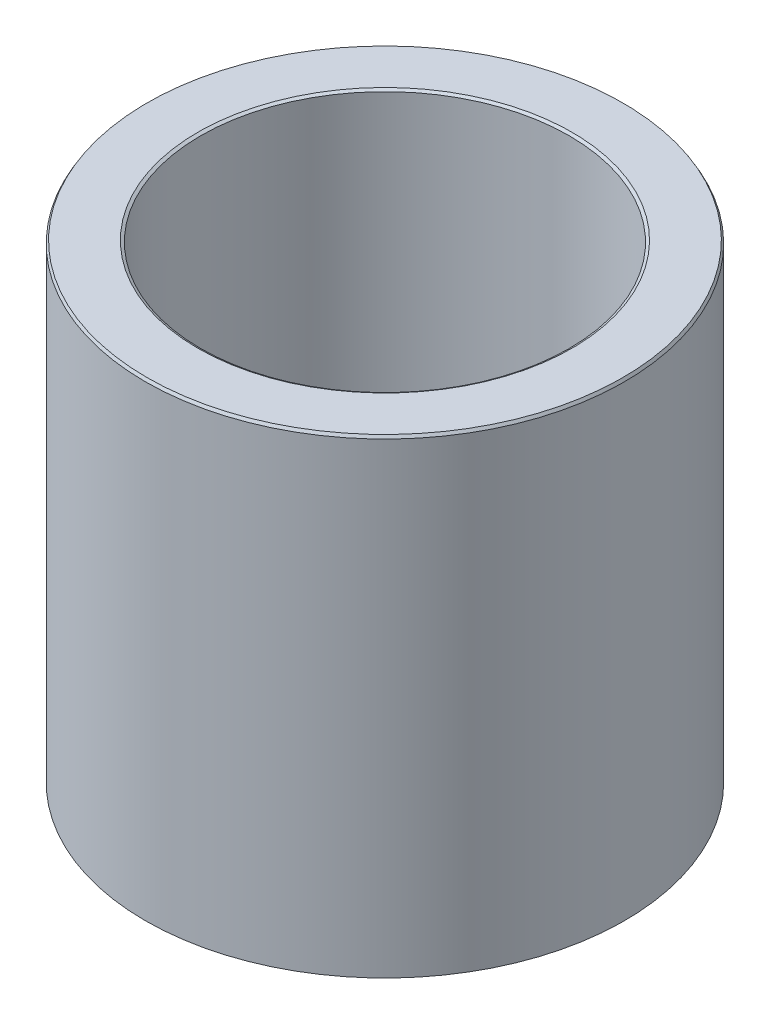
ISO-10303-21;
HEADER;
FILE_DESCRIPTION(('STEP AP214'),'2;1');
FILE_NAME('part.step','',(''),(''),'','','');
FILE_SCHEMA(('AUTOMOTIVE_DESIGN { 1 0 10303 214 1 1 1 1 }'));
ENDSEC;
DATA;
#1=APPLICATION_CONTEXT('core data for automotive mechanical design processes');
#2=APPLICATION_PROTOCOL_DEFINITION('international standard','automotive_design',2000,#1);
#3=PRODUCT_CONTEXT('',#1,'mechanical');
#4=PRODUCT('Part','Part','',(#3));
#5=PRODUCT_RELATED_PRODUCT_CATEGORY('part','',(#4));
#6=PRODUCT_DEFINITION_FORMATION('','',#4);
#7=PRODUCT_DEFINITION_CONTEXT('part definition',#1,'design');
#8=PRODUCT_DEFINITION('design','',#6,#7);
#9=PRODUCT_DEFINITION_SHAPE('','',#8);
#10=(LENGTH_UNIT() NAMED_UNIT(*) SI_UNIT(.MILLI.,.METRE.));
#11=(NAMED_UNIT(*) PLANE_ANGLE_UNIT() SI_UNIT($,.RADIAN.));
#12=(NAMED_UNIT(*) SI_UNIT($,.STERADIAN.) SOLID_ANGLE_UNIT());
#13=UNCERTAINTY_MEASURE_WITH_UNIT(LENGTH_MEASURE(1.E-05),#10,'distance_accuracy_value','');
#14=(GEOMETRIC_REPRESENTATION_CONTEXT(3) GLOBAL_UNCERTAINTY_ASSIGNED_CONTEXT((#13)) GLOBAL_UNIT_ASSIGNED_CONTEXT((#10,
#11,#12)) REPRESENTATION_CONTEXT('',''));
#15=CARTESIAN_POINT('',(0.,0.,0.));
#16=DIRECTION('',(0.,0.,1.));
#17=DIRECTION('',(1.,0.,0.));
#18=AXIS2_PLACEMENT_3D('',#15,#16,#17);
#19=CARTESIAN_POINT('',(0.,108.201678692857,0.));
#20=DIRECTION('',(0.,-1.,0.));
#21=DIRECTION('',(0.,0.,-1.));
#22=AXIS2_PLACEMENT_3D('',#19,#20,#21);
#23=CYLINDRICAL_SURFACE('',#22,55.);
#24=CARTESIAN_POINT('',(0.,0.373626773049751,0.));
#25=DIRECTION('',(0.,1.,0.));
#26=DIRECTION('',(0.,0.,1.));
#27=AXIS2_PLACEMENT_3D('',#24,#25,#26);
#28=CIRCLE('',#27,55.);
#29=CARTESIAN_POINT('',(0.,0.373626773049751,55.));
#30=VERTEX_POINT('',#29);
#31=EDGE_CURVE('E10',#30,#30,#28,.T.);
#32=ORIENTED_EDGE('',*,*,#31,.T.);
#33=EDGE_LOOP('',(#32));
#34=FACE_BOUND('',#33,.T.);
#35=CARTESIAN_POINT('',(0.,107.554538138867,0.));
#36=DIRECTION('',(0.,1.,0.));
#37=DIRECTION('',(0.,0.,1.));
#38=AXIS2_PLACEMENT_3D('',#35,#36,#37);
#39=CIRCLE('',#38,55.);
#40=CARTESIAN_POINT('',(0.,107.554538138867,55.));
#41=VERTEX_POINT('',#40);
#42=EDGE_CURVE('E50',#41,#41,#39,.F.);
#43=ORIENTED_EDGE('',*,*,#42,.T.);
#44=EDGE_LOOP('',(#43));
#45=FACE_BOUND('',#44,.T.);
#46=ADVANCED_FACE('F39',(#34,#45),#23,.T.);
#47=CARTESIAN_POINT('',(0.,108.201678692857,0.));
#48=DIRECTION('',(0.,1.,0.));
#49=DIRECTION('',(0.,0.,1.));
#50=AXIS2_PLACEMENT_3D('',#47,#48,#49);
#51=PLANE('',#50);
#52=CARTESIAN_POINT('',(0.,108.201678692857,0.));
#53=DIRECTION('',(0.,1.,0.));
#54=DIRECTION('',(0.,0.,1.));
#55=AXIS2_PLACEMENT_3D('',#52,#53,#54);
#56=CIRCLE('',#55,42.9613870123271);
#57=CARTESIAN_POINT('',(0.,108.201678692857,42.9613870123271));
#58=VERTEX_POINT('',#57);
#59=EDGE_CURVE('E58',#58,#58,#56,.F.);
#60=ORIENTED_EDGE('',*,*,#59,.T.);
#61=EDGE_LOOP('',(#60));
#62=FACE_BOUND('',#61,.T.);
#63=CARTESIAN_POINT('',(0.,108.201678692857,0.));
#64=DIRECTION('',(0.,1.,0.));
#65=DIRECTION('',(0.,0.,1.));
#66=AXIS2_PLACEMENT_3D('',#63,#64,#65);
#67=CIRCLE('',#66,54.6263732269502);
#68=CARTESIAN_POINT('',(0.,108.201678692857,54.6263732269502));
#69=VERTEX_POINT('',#68);
#70=EDGE_CURVE('E61',#69,#69,#67,.T.);
#71=ORIENTED_EDGE('',*,*,#70,.T.);
#72=EDGE_LOOP('',(#71));
#73=FACE_BOUND('',#72,.T.);
#74=ADVANCED_FACE('F88',(#62,#73),#51,.T.);
#75=CARTESIAN_POINT('',(0.,0.,0.));
#76=DIRECTION('',(0.,1.,0.));
#77=DIRECTION('',(0.,0.,1.));
#78=AXIS2_PLACEMENT_3D('',#75,#76,#77);
#79=PLANE('',#78);
#80=CARTESIAN_POINT('',(0.,0.,0.));
#81=DIRECTION('',(0.,1.,0.));
#82=DIRECTION('',(0.,0.,1.));
#83=AXIS2_PLACEMENT_3D('',#80,#81,#82);
#84=CIRCLE('',#83,42.6878732313868);
#85=CARTESIAN_POINT('',(0.,0.,-42.6878732313868));
#86=VERTEX_POINT('',#85);
#87=EDGE_CURVE('E51',#86,#86,#84,.T.);
#88=ORIENTED_EDGE('',*,*,#87,.T.);
#89=EDGE_LOOP('',(#88));
#90=FACE_BOUND('',#89,.T.);
#91=CARTESIAN_POINT('',(0.,0.,0.));
#92=DIRECTION('',(0.,1.,0.));
#93=DIRECTION('',(0.,0.,1.));
#94=AXIS2_PLACEMENT_3D('',#91,#92,#93);
#95=CIRCLE('',#94,54.3528594460098);
#96=CARTESIAN_POINT('',(0.,0.,54.3528594460098));
#97=VERTEX_POINT('',#96);
#98=EDGE_CURVE('E54',#97,#97,#95,.F.);
#99=ORIENTED_EDGE('',*,*,#98,.T.);
#100=EDGE_LOOP('',(#99));
#101=FACE_BOUND('',#100,.T.);
#102=ADVANCED_FACE('F83',(#90,#101),#79,.F.);
#103=CARTESIAN_POINT('',(0.,108.201678692857,0.));
#104=DIRECTION('',(0.,-1.,0.));
#105=DIRECTION('',(0.,0.,-1.));
#106=AXIS2_PLACEMENT_3D('',#103,#104,#105);
#107=CYLINDRICAL_SURFACE('',#106,42.314246458337);
#108=CARTESIAN_POINT('',(0.,107.828051919808,0.));
#109=DIRECTION('',(0.,1.,0.));
#110=DIRECTION('',(0.,0.,1.));
#111=AXIS2_PLACEMENT_3D('',#108,#109,#110);
#112=CIRCLE('',#111,42.314246458337);
#113=CARTESIAN_POINT('',(0.,107.828051919808,42.314246458337));
#114=VERTEX_POINT('',#113);
#115=EDGE_CURVE('E67',#114,#114,#112,.T.);
#116=ORIENTED_EDGE('',*,*,#115,.T.);
#117=EDGE_LOOP('',(#116));
#118=FACE_BOUND('',#117,.T.);
#119=CARTESIAN_POINT('',(0.,0.647140553990191,0.));
#120=DIRECTION('',(0.,1.,0.));
#121=DIRECTION('',(0.,0.,1.));
#122=AXIS2_PLACEMENT_3D('',#119,#120,#121);
#123=CIRCLE('',#122,42.314246458337);
#124=CARTESIAN_POINT('',(0.,0.647140553990191,-42.314246458337));
#125=VERTEX_POINT('',#124);
#126=EDGE_CURVE('E69',#125,#125,#123,.F.);
#127=ORIENTED_EDGE('',*,*,#126,.T.);
#128=EDGE_LOOP('',(#127));
#129=FACE_BOUND('',#128,.T.);
#130=ADVANCED_FACE('F71',(#118,#129),#107,.F.);
#131=CARTESIAN_POINT('',(0.,107.828051919808,0.));
#132=DIRECTION('',(0.,1.,0.));
#133=DIRECTION('',(0.,0.,1.));
#134=AXIS2_PLACEMENT_3D('',#131,#132,#133);
#135=CONICAL_SURFACE('',#134,42.314246458337,1.04719755119659);
#136=ORIENTED_EDGE('',*,*,#59,.F.);
#137=EDGE_LOOP('',(#136));
#138=FACE_BOUND('',#137,.T.);
#139=ORIENTED_EDGE('',*,*,#115,.F.);
#140=EDGE_LOOP('',(#139));
#141=FACE_BOUND('',#140,.T.);
#142=ADVANCED_FACE('F77',(#138,#141),#135,.F.);
#143=CARTESIAN_POINT('',(0.,0.,0.));
#144=DIRECTION('',(0.,-1.,0.));
#145=DIRECTION('',(0.,0.,-1.));
#146=AXIS2_PLACEMENT_3D('',#143,#144,#145);
#147=CONICAL_SURFACE('',#146,42.6878732313868,0.523598775598296);
#148=CARTESIAN_POINT('',(0.,0.647140553990191,-42.314246458337));
#149=CARTESIAN_POINT('',(0.,0.640399506552795,-42.3181384038896));
#150=CARTESIAN_POINT('',(0.,0.633658459115397,-42.3220303494422));
#151=CARTESIAN_POINT('',(0.,0.6201763642406,-42.3298142405474));
#152=CARTESIAN_POINT('',(0.,0.613435316803202,-42.3337061861));
#153=CARTESIAN_POINT('',(0.,0.599953221928406,-42.3414900772052));
#154=CARTESIAN_POINT('',(0.,0.593212174491009,-42.3453820227578));
#155=CARTESIAN_POINT('',(0.,0.579730079616214,-42.353165913863));
#156=CARTESIAN_POINT('',(0.,0.572989032178815,-42.3570578594156));
#157=CARTESIAN_POINT('',(0.,0.559506937304019,-42.3648417505208));
#158=CARTESIAN_POINT('',(0.,0.552765889866622,-42.3687336960734));
#159=CARTESIAN_POINT('',(0.,0.539283794991827,-42.3765175871786));
#160=CARTESIAN_POINT('',(0.,0.532542747554428,-42.3804095327312));
#161=CARTESIAN_POINT('',(0.,0.519060652679632,-42.3881934238364));
#162=CARTESIAN_POINT('',(0.,0.512319605242235,-42.392085369389));
#163=CARTESIAN_POINT('',(0.,0.49883751036744,-42.3998692604942));
#164=CARTESIAN_POINT('',(0.,0.492096462930041,-42.4037612060468));
#165=CARTESIAN_POINT('',(0.,0.478614368055245,-42.411545097152));
#166=CARTESIAN_POINT('',(0.,0.471873320617848,-42.4154370427046));
#167=CARTESIAN_POINT('',(0.,0.458391225743053,-42.4232209338098));
#168=CARTESIAN_POINT('',(0.,0.451650178305654,-42.4271128793624));
#169=CARTESIAN_POINT('',(0.,0.438168083430858,-42.4348967704676));
#170=CARTESIAN_POINT('',(0.,0.431427035993461,-42.4387887160202));
#171=CARTESIAN_POINT('',(0.,0.417944941118666,-42.4465726071254));
#172=CARTESIAN_POINT('',(0.,0.411203893681267,-42.450464552678));
#173=CARTESIAN_POINT('',(0.,0.397721798806471,-42.4582484437832));
#174=CARTESIAN_POINT('',(0.,0.390980751369074,-42.4621403893359));
#175=CARTESIAN_POINT('',(0.,0.377498656494279,-42.4699242804411));
#176=CARTESIAN_POINT('',(0.,0.37075760905688,-42.4738162259937));
#177=CARTESIAN_POINT('',(0.,0.357275514182084,-42.4816001170989));
#178=CARTESIAN_POINT('',(0.,0.350534466744687,-42.4854920626515));
#179=CARTESIAN_POINT('',(0.,0.337052371869892,-42.4932759537567));
#180=CARTESIAN_POINT('',(0.,0.330311324432493,-42.4971678993093));
#181=CARTESIAN_POINT('',(0.,0.316829229557697,-42.5049517904145));
#182=CARTESIAN_POINT('',(0.,0.3100881821203,-42.5088437359671));
#183=CARTESIAN_POINT('',(0.,0.296606087245505,-42.5166276270723));
#184=CARTESIAN_POINT('',(0.,0.289865039808107,-42.5205195726249));
#185=CARTESIAN_POINT('',(0.,0.276382944933311,-42.5283034637301));
#186=CARTESIAN_POINT('',(0.,0.269641897495912,-42.5321954092827));
#187=CARTESIAN_POINT('',(0.,0.256159802621117,-42.5399793003879));
#188=CARTESIAN_POINT('',(0.,0.24941875518372,-42.5438712459405));
#189=CARTESIAN_POINT('',(0.,0.235936660308924,-42.5516551370457));
#190=CARTESIAN_POINT('',(0.,0.229195612871526,-42.5555470825983));
#191=CARTESIAN_POINT('',(0.,0.21571351799673,-42.5633309737035));
#192=CARTESIAN_POINT('',(0.,0.208972470559333,-42.5672229192561));
#193=CARTESIAN_POINT('',(0.,0.195490375684537,-42.5750068103613));
#194=CARTESIAN_POINT('',(0.,0.188749328247139,-42.5788987559139));
#195=CARTESIAN_POINT('',(0.,0.175267233372343,-42.5866826470191));
#196=CARTESIAN_POINT('',(0.,0.168526185934946,-42.5905745925717));
#197=CARTESIAN_POINT('',(0.,0.155044091060151,-42.5983584836769));
#198=CARTESIAN_POINT('',(0.,0.148303043622752,-42.6022504292295));
#199=CARTESIAN_POINT('',(0.,0.134820948747956,-42.6100343203347));
#200=CARTESIAN_POINT('',(0.,0.128079901310559,-42.6139262658873));
#201=CARTESIAN_POINT('',(0.,0.114597806435764,-42.6217101569925));
#202=CARTESIAN_POINT('',(0.,0.107856758998365,-42.6256021025451));
#203=CARTESIAN_POINT('',(0.,0.0943746641235691,-42.6333859936503));
#204=CARTESIAN_POINT('',(0.,0.0876336166861722,-42.6372779392029));
#205=CARTESIAN_POINT('',(0.,0.0741515218113766,-42.6450618303081));
#206=CARTESIAN_POINT('',(0.,0.0674104743739778,-42.6489537758607));
#207=CARTESIAN_POINT('',(0.,0.0539283794991821,-42.6567376669659));
#208=CARTESIAN_POINT('',(0.,0.0471873320617851,-42.6606296125185));
#209=CARTESIAN_POINT('',(0.,0.0337052371869898,-42.6684135036237));
#210=CARTESIAN_POINT('',(0.,0.0269641897495914,-42.6723054491763));
#211=CARTESIAN_POINT('',(0.,0.0134820948747946,-42.6800893402815));
#212=CARTESIAN_POINT('',(0.,0.00674104743739618,-42.6839812858341));
#213=CARTESIAN_POINT('',(0.,0.,-42.6878732313868));
#214=B_SPLINE_CURVE_WITH_KNOTS('',3,(#148,#149,#150,#151,#152,#153,#154,#155,#156,#157,#158,
#159,#160,#161,#162,#163,#164,#165,#166,#167,#168,#169,#170,#171,#172,#173,#174,#175,#176,#177,
#178,#179,#180,#181,#182,#183,#184,#185,#186,#187,#188,#189,#190,#191,#192,#193,#194,#195,#196,
#197,#198,#199,#200,#201,#202,#203,#204,#205,#206,#207,#208,#209,#210,#211,#212,#213),
.UNSPECIFIED.,.F.,.F.,(4,2,2,2,2,2,2,2,2,2,2,2,2,2,2,2,2,2,2,2,2,2,2,2,2,2,2,2,2,2,2,2,4),(0.,
0.0233516733156116,0.0467033466312198,0.0700550199468314,0.0934066932624396,0.116758366578051,
0.140110039893659,0.163461713209271,0.186813386524879,0.210165059840491,0.233516733156099,
0.25686840647171,0.280220079787319,0.30357175310293,0.326923426418538,0.35027509973415,
0.373626773049758,0.39697844636537,0.420330119680981,0.443681792996589,0.467033466312201,
0.490385139627809,0.513736812943421,0.537088486259029,0.560440159574641,0.583791832890249,
0.60714350620586,0.630495179521469,0.65384685283708,0.677198526152688,0.7005501994683,
0.723901872783908,0.74725354609952),.UNSPECIFIED.);
#215=EDGE_CURVE('BSEAM73',#125,#86,#214,.T.);
#216=ORIENTED_EDGE('',*,*,#126,.F.);
#217=ORIENTED_EDGE('',*,*,#87,.F.);
#218=ORIENTED_EDGE('',*,*,#215,.T.);
#219=ORIENTED_EDGE('',*,*,#215,.F.);
#220=EDGE_LOOP('',(#216,#218,#217,#219));
#221=FACE_BOUND('',#220,.T.);
#222=ADVANCED_FACE('F73',(#221),#147,.F.);
#223=CARTESIAN_POINT('',(0.,0.373626773049751,0.));
#224=DIRECTION('',(0.,1.,0.));
#225=DIRECTION('',(0.,0.,1.));
#226=AXIS2_PLACEMENT_3D('',#223,#224,#225);
#227=CONICAL_SURFACE('',#226,55.,1.04719755119661);
#228=ORIENTED_EDGE('',*,*,#98,.F.);
#229=EDGE_LOOP('',(#228));
#230=FACE_BOUND('',#229,.T.);
#231=ORIENTED_EDGE('',*,*,#31,.F.);
#232=EDGE_LOOP('',(#231));
#233=FACE_BOUND('',#232,.T.);
#234=ADVANCED_FACE('F76',(#230,#233),#227,.T.);
#235=CARTESIAN_POINT('',(0.,108.201678692857,0.));
#236=DIRECTION('',(0.,-1.,0.));
#237=DIRECTION('',(0.,0.,-1.));
#238=AXIS2_PLACEMENT_3D('',#235,#236,#237);
#239=CONICAL_SURFACE('',#238,54.6263732269502,0.523598775598303);
#240=ORIENTED_EDGE('',*,*,#42,.F.);
#241=EDGE_LOOP('',(#240));
#242=FACE_BOUND('',#241,.T.);
#243=ORIENTED_EDGE('',*,*,#70,.F.);
#244=EDGE_LOOP('',(#243));
#245=FACE_BOUND('',#244,.T.);
#246=ADVANCED_FACE('F45',(#242,#245),#239,.T.);
#247=CLOSED_SHELL('',(#46,#74,#102,#130,#142,#222,#234,#246));
#248=MANIFOLD_SOLID_BREP('B2',#247);
#249=ADVANCED_BREP_SHAPE_REPRESENTATION('',(#18,#248),#14);
#250=SHAPE_DEFINITION_REPRESENTATION(#9,#249);
ENDSEC;
END-ISO-10303-21;
